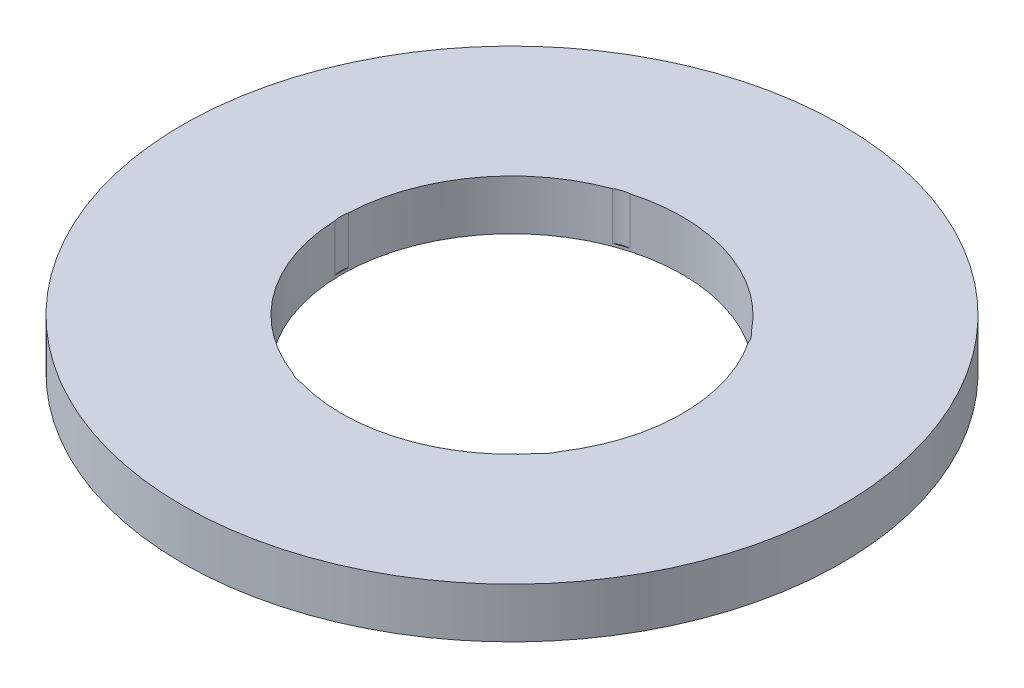
ISO-10303-21;
HEADER;
FILE_DESCRIPTION(('STEP AP214'),'2;1');
FILE_NAME('part.step','',(''),(''),'','','');
FILE_SCHEMA(('AUTOMOTIVE_DESIGN { 1 0 10303 214 1 1 1 1 }'));
ENDSEC;
DATA;
#1=APPLICATION_CONTEXT('core data for automotive mechanical design processes');
#2=APPLICATION_PROTOCOL_DEFINITION('international standard','automotive_design',2000,#1);
#3=PRODUCT_CONTEXT('',#1,'mechanical');
#4=PRODUCT('Part','Part','',(#3));
#5=PRODUCT_RELATED_PRODUCT_CATEGORY('part','',(#4));
#6=PRODUCT_DEFINITION_FORMATION('','',#4);
#7=PRODUCT_DEFINITION_CONTEXT('part definition',#1,'design');
#8=PRODUCT_DEFINITION('design','',#6,#7);
#9=PRODUCT_DEFINITION_SHAPE('','',#8);
#10=(LENGTH_UNIT() NAMED_UNIT(*) SI_UNIT(.MILLI.,.METRE.));
#11=(NAMED_UNIT(*) PLANE_ANGLE_UNIT() SI_UNIT($,.RADIAN.));
#12=(NAMED_UNIT(*) SI_UNIT($,.STERADIAN.) SOLID_ANGLE_UNIT());
#13=UNCERTAINTY_MEASURE_WITH_UNIT(LENGTH_MEASURE(1.E-05),#10,'distance_accuracy_value','');
#14=(GEOMETRIC_REPRESENTATION_CONTEXT(3) GLOBAL_UNCERTAINTY_ASSIGNED_CONTEXT((#13)) GLOBAL_UNIT_ASSIGNED_CONTEXT((#10,
#11,#12)) REPRESENTATION_CONTEXT('',''));
#15=CARTESIAN_POINT('',(0.,0.,0.));
#16=DIRECTION('',(0.,0.,1.));
#17=DIRECTION('',(1.,0.,0.));
#18=AXIS2_PLACEMENT_3D('',#15,#16,#17);
#19=CARTESIAN_POINT('',(0.,11.,0.));
#20=DIRECTION('',(0.,-1.,0.));
#21=DIRECTION('',(0.,0.,-1.));
#22=AXIS2_PLACEMENT_3D('',#19,#20,#21);
#23=CYLINDRICAL_SURFACE('',#22,72.5);
#24=CARTESIAN_POINT('',(0.,11.,0.));
#25=DIRECTION('',(0.,1.,0.));
#26=DIRECTION('',(0.,0.,1.));
#27=AXIS2_PLACEMENT_3D('',#24,#25,#26);
#28=CIRCLE('',#27,72.5);
#29=CARTESIAN_POINT('',(0.,11.,72.5));
#30=VERTEX_POINT('',#29);
#31=EDGE_CURVE('E151',#30,#30,#28,.T.);
#32=ORIENTED_EDGE('',*,*,#31,.F.);
#33=EDGE_LOOP('',(#32));
#34=FACE_BOUND('',#33,.T.);
#35=CARTESIAN_POINT('',(0.,0.,0.));
#36=DIRECTION('',(0.,1.,0.));
#37=DIRECTION('',(0.,0.,1.));
#38=AXIS2_PLACEMENT_3D('',#35,#36,#37);
#39=CIRCLE('',#38,72.5);
#40=CARTESIAN_POINT('',(0.,0.,72.5));
#41=VERTEX_POINT('',#40);
#42=EDGE_CURVE('E150',#41,#41,#39,.T.);
#43=ORIENTED_EDGE('',*,*,#42,.T.);
#44=EDGE_LOOP('',(#43));
#45=FACE_BOUND('',#44,.T.);
#46=ADVANCED_FACE('F39',(#34,#45),#23,.T.);
#47=CARTESIAN_POINT('',(0.,11.,0.));
#48=DIRECTION('',(0.,1.,0.));
#49=DIRECTION('',(0.,0.,1.));
#50=AXIS2_PLACEMENT_3D('',#47,#48,#49);
#51=PLANE('',#50);
#52=CARTESIAN_POINT('',(-9.75995920303515,11.,-30.0380657626822));
#53=DIRECTION('',(0.,1.,0.));
#54=DIRECTION('',(-0.95105651629515,0.,0.309016994374958));
#55=AXIS2_PLACEMENT_3D('',#52,#53,#54);
#56=CIRCLE('',#55,6.0783892815218);
#57=CARTESIAN_POINT('',(-10.1330941288525,11.,-36.1049913914381));
#58=VERTEX_POINT('',#57);
#59=CARTESIAN_POINT('',(-13.0241361181921,11.,-35.1656349064652));
#60=VERTEX_POINT('',#59);
#61=EDGE_CURVE('E196',#58,#60,#56,.T.);
#62=ORIENTED_EDGE('',*,*,#61,.F.);
#63=CARTESIAN_POINT('',(0.,11.,0.));
#64=DIRECTION('',(0.,1.,0.));
#65=DIRECTION('',(0.,0.,1.));
#66=AXIS2_PLACEMENT_3D('',#63,#64,#65);
#67=CIRCLE('',#66,37.5);
#68=CARTESIAN_POINT('',(29.4198268298762,11.,-23.2534683284042));
#69=VERTEX_POINT('',#68);
#70=EDGE_CURVE('E156',#69,#58,#67,.T.);
#71=ORIENTED_EDGE('',*,*,#70,.F.);
#72=CARTESIAN_POINT('',(25.5519049223573,11.,-18.5645455976424));
#73=DIRECTION('',(0.,1.,0.));
#74=DIRECTION('',(-0.58778525229248,0.,-0.809016994374942));
#75=AXIS2_PLACEMENT_3D('',#72,#73,#74);
#76=CIRCLE('',#75,6.0783892815218);
#77=CARTESIAN_POINT('',(31.2065890421912,11.,-20.7942011231928));
#78=VERTEX_POINT('',#77);
#79=EDGE_CURVE('E254',#78,#69,#76,.T.);
#80=ORIENTED_EDGE('',*,*,#79,.F.);
#81=CARTESIAN_POINT('',(31.2065890421915,11.,20.7942011231923));
#82=VERTEX_POINT('',#81);
#83=EDGE_CURVE('E153',#82,#78,#67,.T.);
#84=ORIENTED_EDGE('',*,*,#83,.F.);
#85=CARTESIAN_POINT('',(25.5519049223576,11.,18.5645455976421));
#86=DIRECTION('',(0.,1.,0.));
#87=DIRECTION('',(0.587785252292469,0.,-0.809016994374951));
#88=AXIS2_PLACEMENT_3D('',#85,#86,#87);
#89=CIRCLE('',#88,6.0783892815218);
#90=CARTESIAN_POINT('',(29.4198268298765,11.,23.2534683284038));
#91=VERTEX_POINT('',#90);
#92=EDGE_CURVE('E248',#91,#82,#89,.T.);
#93=ORIENTED_EDGE('',*,*,#92,.F.);
#94=CARTESIAN_POINT('',(-10.1330941288519,11.,36.1049913914382));
#95=VERTEX_POINT('',#94);
#96=EDGE_CURVE('E140',#95,#91,#67,.T.);
#97=ORIENTED_EDGE('',*,*,#96,.F.);
#98=CARTESIAN_POINT('',(-9.75995920303473,11.,30.0380657626824));
#99=DIRECTION('',(0.,1.,0.));
#100=DIRECTION('',(0.951056516295155,0.,0.309016994374945));
#101=AXIS2_PLACEMENT_3D('',#98,#99,#100);
#102=CIRCLE('',#101,6.0783892815218);
#103=CARTESIAN_POINT('',(-13.0241361181917,11.,35.1656349064654));
#104=VERTEX_POINT('',#103);
#105=EDGE_CURVE('E117',#104,#95,#102,.T.);
#106=ORIENTED_EDGE('',*,*,#105,.F.);
#107=CARTESIAN_POINT('',(-37.469185625024,11.,1.51991072023867));
#108=VERTEX_POINT('',#107);
#109=EDGE_CURVE('E133',#108,#104,#67,.T.);
#110=ORIENTED_EDGE('',*,*,#109,.F.);
#111=CARTESIAN_POINT('',(-31.5838914386453,11.,0.));
#112=DIRECTION('',(0.,1.,0.));
#113=DIRECTION('',(0.,0.,1.));
#114=AXIS2_PLACEMENT_3D('',#111,#112,#113);
#115=CIRCLE('',#114,6.0783892815218);
#116=CARTESIAN_POINT('',(-37.469185625024,11.,-1.51991072023867));
#117=VERTEX_POINT('',#116);
#118=EDGE_CURVE('E170',#117,#108,#115,.T.);
#119=ORIENTED_EDGE('',*,*,#118,.F.);
#120=EDGE_CURVE('E149',#60,#117,#67,.T.);
#121=ORIENTED_EDGE('',*,*,#120,.F.);
#122=EDGE_LOOP('',(#62,#71,#80,#84,#93,#97,#106,#110,#119,#121));
#123=FACE_BOUND('',#122,.T.);
#124=ORIENTED_EDGE('',*,*,#31,.T.);
#125=EDGE_LOOP('',(#124));
#126=FACE_BOUND('',#125,.T.);
#127=ADVANCED_FACE('F131',(#123,#126),#51,.T.);
#128=CARTESIAN_POINT('',(0.,0.,0.));
#129=DIRECTION('',(0.,1.,0.));
#130=DIRECTION('',(0.,0.,1.));
#131=AXIS2_PLACEMENT_3D('',#128,#129,#130);
#132=PLANE('',#131);
#133=CARTESIAN_POINT('',(0.,0.,0.));
#134=DIRECTION('',(0.,1.,0.));
#135=DIRECTION('',(0.,0.,1.));
#136=AXIS2_PLACEMENT_3D('',#133,#134,#135);
#137=CIRCLE('',#136,37.5);
#138=CARTESIAN_POINT('',(0.,0.,37.5));
#139=VERTEX_POINT('',#138);
#140=EDGE_CURVE('E160',#139,#139,#137,.T.);
#141=ORIENTED_EDGE('',*,*,#140,.T.);
#142=EDGE_LOOP('',(#141));
#143=FACE_BOUND('',#142,.T.);
#144=ORIENTED_EDGE('',*,*,#42,.F.);
#145=EDGE_LOOP('',(#144));
#146=FACE_BOUND('',#145,.T.);
#147=ADVANCED_FACE('F212',(#143,#146),#132,.F.);
#148=CARTESIAN_POINT('',(0.,11.,0.));
#149=DIRECTION('',(0.,-1.,0.));
#150=DIRECTION('',(0.,0.,-1.));
#151=AXIS2_PLACEMENT_3D('',#148,#149,#150);
#152=CYLINDRICAL_SURFACE('',#151,37.5);
#153=DIRECTION('',(0.,1.,0.));
#154=VECTOR('',#153,1.);
#155=CARTESIAN_POINT('',(-10.1330941288525,5.79717778050128,-36.1049913914381));
#156=LINE('',#155,#154);
#157=CARTESIAN_POINT('',(-10.1330941288525,0.59435556100257,-36.1049913914381));
#158=VERTEX_POINT('',#157);
#159=EDGE_CURVE('E11',#158,#58,#156,.T.);
#160=ORIENTED_EDGE('',*,*,#159,.F.);
#161=CARTESIAN_POINT('',(0.,0.59435556100257,0.));
#162=DIRECTION('',(0.,1.,0.));
#163=DIRECTION('',(0.,0.,1.));
#164=AXIS2_PLACEMENT_3D('',#161,#162,#163);
#165=CIRCLE('',#164,37.5);
#166=CARTESIAN_POINT('',(-13.0241361181921,0.59435556100257,-35.1656349064652));
#167=VERTEX_POINT('',#166);
#168=EDGE_CURVE('E193',#158,#167,#165,.T.);
#169=ORIENTED_EDGE('',*,*,#168,.T.);
#170=DIRECTION('',(0.,1.,0.));
#171=VECTOR('',#170,1.);
#172=CARTESIAN_POINT('',(-13.0241361181921,5.79717778050128,-35.1656349064652));
#173=LINE('',#172,#171);
#174=EDGE_CURVE('E46',#60,#167,#173,.F.);
#175=ORIENTED_EDGE('',*,*,#174,.F.);
#176=ORIENTED_EDGE('',*,*,#120,.T.);
#177=DIRECTION('',(0.,1.,0.));
#178=VECTOR('',#177,1.);
#179=CARTESIAN_POINT('',(-37.469185625024,5.79717778050128,-1.51991072023863));
#180=LINE('',#179,#178);
#181=CARTESIAN_POINT('',(-37.469185625024,0.59435556100257,-1.51991072023867));
#182=VERTEX_POINT('',#181);
#183=EDGE_CURVE('E174',#182,#117,#180,.T.);
#184=ORIENTED_EDGE('',*,*,#183,.F.);
#185=CARTESIAN_POINT('',(0.,0.59435556100257,0.));
#186=DIRECTION('',(0.,1.,0.));
#187=DIRECTION('',(0.,0.,1.));
#188=AXIS2_PLACEMENT_3D('',#185,#186,#187);
#189=CIRCLE('',#188,37.5);
#190=CARTESIAN_POINT('',(-37.469185625024,0.59435556100257,1.51991072023867));
#191=VERTEX_POINT('',#190);
#192=EDGE_CURVE('E171',#182,#191,#189,.T.);
#193=ORIENTED_EDGE('',*,*,#192,.T.);
#194=DIRECTION('',(0.,1.,0.));
#195=VECTOR('',#194,1.);
#196=CARTESIAN_POINT('',(-37.469185625024,5.79717778050128,1.51991072023863));
#197=LINE('',#196,#195);
#198=EDGE_CURVE('E148',#108,#191,#197,.F.);
#199=ORIENTED_EDGE('',*,*,#198,.F.);
#200=ORIENTED_EDGE('',*,*,#109,.T.);
#201=DIRECTION('',(0.,1.,0.));
#202=VECTOR('',#201,1.);
#203=CARTESIAN_POINT('',(-13.0241361181916,5.79717778050128,35.1656349064654));
#204=LINE('',#203,#202);
#205=CARTESIAN_POINT('',(-13.0241361181917,0.59435556100257,35.1656349064654));
#206=VERTEX_POINT('',#205);
#207=EDGE_CURVE('E111',#206,#104,#204,.T.);
#208=ORIENTED_EDGE('',*,*,#207,.F.);
#209=CARTESIAN_POINT('',(0.,0.59435556100257,0.));
#210=DIRECTION('',(0.,1.,0.));
#211=DIRECTION('',(0.,0.,1.));
#212=AXIS2_PLACEMENT_3D('',#209,#210,#211);
#213=CIRCLE('',#212,37.5);
#214=CARTESIAN_POINT('',(-10.1330941288519,0.59435556100257,36.1049913914382));
#215=VERTEX_POINT('',#214);
#216=EDGE_CURVE('E180',#206,#215,#213,.T.);
#217=ORIENTED_EDGE('',*,*,#216,.T.);
#218=DIRECTION('',(0.,1.,0.));
#219=VECTOR('',#218,1.);
#220=CARTESIAN_POINT('',(-10.133094128852,5.79717778050128,36.1049913914382));
#221=LINE('',#220,#219);
#222=EDGE_CURVE('E124',#95,#215,#221,.F.);
#223=ORIENTED_EDGE('',*,*,#222,.F.);
#224=ORIENTED_EDGE('',*,*,#96,.T.);
#225=DIRECTION('',(0.,1.,0.));
#226=VECTOR('',#225,1.);
#227=CARTESIAN_POINT('',(29.4198268298765,5.79717778050128,23.2534683284038));
#228=LINE('',#227,#226);
#229=CARTESIAN_POINT('',(29.4198268298765,0.59435556100257,23.2534683284038));
#230=VERTEX_POINT('',#229);
#231=EDGE_CURVE('E183',#230,#91,#228,.T.);
#232=ORIENTED_EDGE('',*,*,#231,.F.);
#233=CARTESIAN_POINT('',(0.,0.59435556100257,0.));
#234=DIRECTION('',(0.,1.,0.));
#235=DIRECTION('',(0.,0.,1.));
#236=AXIS2_PLACEMENT_3D('',#233,#234,#235);
#237=CIRCLE('',#236,37.5);
#238=CARTESIAN_POINT('',(31.2065890421915,0.59435556100257,20.7942011231923));
#239=VERTEX_POINT('',#238);
#240=EDGE_CURVE('E123',#230,#239,#237,.T.);
#241=ORIENTED_EDGE('',*,*,#240,.T.);
#242=DIRECTION('',(0.,1.,0.));
#243=VECTOR('',#242,1.);
#244=CARTESIAN_POINT('',(31.2065890421915,5.79717778050128,20.7942011231923));
#245=LINE('',#244,#243);
#246=EDGE_CURVE('E185',#82,#239,#245,.F.);
#247=ORIENTED_EDGE('',*,*,#246,.F.);
#248=ORIENTED_EDGE('',*,*,#83,.T.);
#249=DIRECTION('',(0.,1.,0.));
#250=VECTOR('',#249,1.);
#251=CARTESIAN_POINT('',(31.2065890421912,5.79717778050128,-20.7942011231928));
#252=LINE('',#251,#250);
#253=CARTESIAN_POINT('',(31.2065890421912,0.59435556100257,-20.7942011231928));
#254=VERTEX_POINT('',#253);
#255=EDGE_CURVE('E195',#254,#78,#252,.T.);
#256=ORIENTED_EDGE('',*,*,#255,.F.);
#257=CARTESIAN_POINT('',(0.,0.59435556100257,0.));
#258=DIRECTION('',(0.,1.,0.));
#259=DIRECTION('',(0.,0.,1.));
#260=AXIS2_PLACEMENT_3D('',#257,#258,#259);
#261=CIRCLE('',#260,37.5);
#262=CARTESIAN_POINT('',(29.4198268298762,0.59435556100257,-23.2534683284042));
#263=VERTEX_POINT('',#262);
#264=EDGE_CURVE('E190',#254,#263,#261,.T.);
#265=ORIENTED_EDGE('',*,*,#264,.T.);
#266=DIRECTION('',(0.,1.,0.));
#267=VECTOR('',#266,1.);
#268=CARTESIAN_POINT('',(29.4198268298762,5.79717778050128,-23.2534683284042));
#269=LINE('',#268,#267);
#270=EDGE_CURVE('E189',#69,#263,#269,.F.);
#271=ORIENTED_EDGE('',*,*,#270,.F.);
#272=ORIENTED_EDGE('',*,*,#70,.T.);
#273=EDGE_LOOP('',(#160,#169,#175,#176,#184,#193,#199,#200,#208,#217,#223,#224,#232,#241,#247,
#248,#256,#265,#271,#272));
#274=FACE_BOUND('',#273,.T.);
#275=ORIENTED_EDGE('',*,*,#140,.F.);
#276=EDGE_LOOP('',(#275));
#277=FACE_BOUND('',#276,.T.);
#278=ADVANCED_FACE('F142',(#274,#277),#152,.F.);
#279=CARTESIAN_POINT('',(-31.5838914386453,0.59435556100257,0.));
#280=DIRECTION('',(0.,1.,0.));
#281=DIRECTION('',(0.,0.,1.));
#282=AXIS2_PLACEMENT_3D('',#279,#280,#281);
#283=CYLINDRICAL_SURFACE('',#282,6.0783892815218);
#284=ORIENTED_EDGE('',*,*,#183,.T.);
#285=ORIENTED_EDGE('',*,*,#118,.T.);
#286=ORIENTED_EDGE('',*,*,#198,.T.);
#287=CARTESIAN_POINT('',(-31.5838914386453,0.59435556100257,0.));
#288=DIRECTION('',(0.,1.,0.));
#289=DIRECTION('',(0.,0.,1.));
#290=AXIS2_PLACEMENT_3D('',#287,#288,#289);
#291=CIRCLE('',#290,6.0783892815218);
#292=EDGE_CURVE('E163',#182,#191,#291,.T.);
#293=ORIENTED_EDGE('',*,*,#292,.F.);
#294=EDGE_LOOP('',(#284,#285,#286,#293));
#295=FACE_BOUND('',#294,.T.);
#296=ADVANCED_FACE('F221',(#295),#283,.F.);
#297=CARTESIAN_POINT('',(-31.5838914386453,0.59435556100257,0.));
#298=DIRECTION('',(0.,1.,0.));
#299=DIRECTION('',(0.,0.,1.));
#300=AXIS2_PLACEMENT_3D('',#297,#298,#299);
#301=PLANE('',#300);
#302=ORIENTED_EDGE('',*,*,#292,.T.);
#303=ORIENTED_EDGE('',*,*,#192,.F.);
#304=EDGE_LOOP('',(#302,#303));
#305=FACE_BOUND('',#304,.T.);
#306=ADVANCED_FACE('F227',(#305),#301,.T.);
#307=CARTESIAN_POINT('',(-9.75995920303473,0.59435556100257,30.0380657626824));
#308=DIRECTION('',(0.,1.,0.));
#309=DIRECTION('',(0.,0.,1.));
#310=AXIS2_PLACEMENT_3D('',#307,#308,#309);
#311=CYLINDRICAL_SURFACE('',#310,6.0783892815218);
#312=ORIENTED_EDGE('',*,*,#207,.T.);
#313=ORIENTED_EDGE('',*,*,#105,.T.);
#314=ORIENTED_EDGE('',*,*,#222,.T.);
#315=CARTESIAN_POINT('',(-9.75995920303473,0.59435556100257,30.0380657626824));
#316=DIRECTION('',(0.,1.,0.));
#317=DIRECTION('',(0.951056516295155,0.,0.309016994374945));
#318=AXIS2_PLACEMENT_3D('',#315,#316,#317);
#319=CIRCLE('',#318,6.0783892815218);
#320=EDGE_CURVE('E119',#206,#215,#319,.T.);
#321=ORIENTED_EDGE('',*,*,#320,.F.);
#322=EDGE_LOOP('',(#312,#313,#314,#321));
#323=FACE_BOUND('',#322,.T.);
#324=ADVANCED_FACE('F116',(#323),#311,.F.);
#325=CARTESIAN_POINT('',(-9.75995920303473,0.59435556100257,30.0380657626824));
#326=DIRECTION('',(0.,1.,0.));
#327=DIRECTION('',(0.951056516295155,0.,0.309016994374945));
#328=AXIS2_PLACEMENT_3D('',#325,#326,#327);
#329=PLANE('',#328);
#330=ORIENTED_EDGE('',*,*,#320,.T.);
#331=ORIENTED_EDGE('',*,*,#216,.F.);
#332=EDGE_LOOP('',(#330,#331));
#333=FACE_BOUND('',#332,.T.);
#334=ADVANCED_FACE('F234',(#333),#329,.T.);
#335=CARTESIAN_POINT('',(25.5519049223576,0.59435556100257,18.5645455976421));
#336=DIRECTION('',(0.,1.,0.));
#337=DIRECTION('',(0.,0.,1.));
#338=AXIS2_PLACEMENT_3D('',#335,#336,#337);
#339=CYLINDRICAL_SURFACE('',#338,6.0783892815218);
#340=ORIENTED_EDGE('',*,*,#231,.T.);
#341=ORIENTED_EDGE('',*,*,#92,.T.);
#342=ORIENTED_EDGE('',*,*,#246,.T.);
#343=CARTESIAN_POINT('',(25.5519049223576,0.59435556100257,18.5645455976421));
#344=DIRECTION('',(0.,1.,0.));
#345=DIRECTION('',(0.587785252292469,0.,-0.809016994374951));
#346=AXIS2_PLACEMENT_3D('',#343,#344,#345);
#347=CIRCLE('',#346,6.0783892815218);
#348=EDGE_CURVE('E137',#230,#239,#347,.T.);
#349=ORIENTED_EDGE('',*,*,#348,.F.);
#350=EDGE_LOOP('',(#340,#341,#342,#349));
#351=FACE_BOUND('',#350,.T.);
#352=ADVANCED_FACE('F240',(#351),#339,.F.);
#353=CARTESIAN_POINT('',(25.5519049223576,0.59435556100257,18.5645455976421));
#354=DIRECTION('',(0.,1.,0.));
#355=DIRECTION('',(0.587785252292469,0.,-0.809016994374951));
#356=AXIS2_PLACEMENT_3D('',#353,#354,#355);
#357=PLANE('',#356);
#358=ORIENTED_EDGE('',*,*,#348,.T.);
#359=ORIENTED_EDGE('',*,*,#240,.F.);
#360=EDGE_LOOP('',(#358,#359));
#361=FACE_BOUND('',#360,.T.);
#362=ADVANCED_FACE('F245',(#361),#357,.T.);
#363=CARTESIAN_POINT('',(25.5519049223573,0.59435556100257,-18.5645455976424));
#364=DIRECTION('',(0.,1.,0.));
#365=DIRECTION('',(0.,0.,1.));
#366=AXIS2_PLACEMENT_3D('',#363,#364,#365);
#367=CYLINDRICAL_SURFACE('',#366,6.0783892815218);
#368=ORIENTED_EDGE('',*,*,#255,.T.);
#369=ORIENTED_EDGE('',*,*,#79,.T.);
#370=ORIENTED_EDGE('',*,*,#270,.T.);
#371=CARTESIAN_POINT('',(25.5519049223573,0.59435556100257,-18.5645455976424));
#372=DIRECTION('',(0.,1.,0.));
#373=DIRECTION('',(-0.58778525229248,0.,-0.809016994374942));
#374=AXIS2_PLACEMENT_3D('',#371,#372,#373);
#375=CIRCLE('',#374,6.0783892815218);
#376=EDGE_CURVE('E56',#254,#263,#375,.T.);
#377=ORIENTED_EDGE('',*,*,#376,.F.);
#378=EDGE_LOOP('',(#368,#369,#370,#377));
#379=FACE_BOUND('',#378,.T.);
#380=ADVANCED_FACE('F264',(#379),#367,.F.);
#381=CARTESIAN_POINT('',(25.5519049223573,0.59435556100257,-18.5645455976424));
#382=DIRECTION('',(0.,1.,0.));
#383=DIRECTION('',(-0.58778525229248,0.,-0.809016994374942));
#384=AXIS2_PLACEMENT_3D('',#381,#382,#383);
#385=PLANE('',#384);
#386=ORIENTED_EDGE('',*,*,#376,.T.);
#387=ORIENTED_EDGE('',*,*,#264,.F.);
#388=EDGE_LOOP('',(#386,#387));
#389=FACE_BOUND('',#388,.T.);
#390=ADVANCED_FACE('F202',(#389),#385,.T.);
#391=CARTESIAN_POINT('',(-9.75995920303515,0.59435556100257,-30.0380657626822));
#392=DIRECTION('',(0.,1.,0.));
#393=DIRECTION('',(0.,0.,1.));
#394=AXIS2_PLACEMENT_3D('',#391,#392,#393);
#395=CYLINDRICAL_SURFACE('',#394,6.0783892815218);
#396=ORIENTED_EDGE('',*,*,#159,.T.);
#397=ORIENTED_EDGE('',*,*,#61,.T.);
#398=ORIENTED_EDGE('',*,*,#174,.T.);
#399=CARTESIAN_POINT('',(-9.75995920303515,0.59435556100257,-30.0380657626822));
#400=DIRECTION('',(0.,1.,0.));
#401=DIRECTION('',(-0.95105651629515,0.,0.309016994374958));
#402=AXIS2_PLACEMENT_3D('',#399,#400,#401);
#403=CIRCLE('',#402,6.0783892815218);
#404=EDGE_CURVE('E55',#158,#167,#403,.T.);
#405=ORIENTED_EDGE('',*,*,#404,.F.);
#406=EDGE_LOOP('',(#396,#397,#398,#405));
#407=FACE_BOUND('',#406,.T.);
#408=ADVANCED_FACE('F197',(#407),#395,.F.);
#409=CARTESIAN_POINT('',(-9.75995920303515,0.59435556100257,-30.0380657626822));
#410=DIRECTION('',(0.,1.,0.));
#411=DIRECTION('',(-0.95105651629515,0.,0.309016994374958));
#412=AXIS2_PLACEMENT_3D('',#409,#410,#411);
#413=PLANE('',#412);
#414=ORIENTED_EDGE('',*,*,#404,.T.);
#415=ORIENTED_EDGE('',*,*,#168,.F.);
#416=EDGE_LOOP('',(#414,#415));
#417=FACE_BOUND('',#416,.T.);
#418=ADVANCED_FACE('F200',(#417),#413,.T.);
#419=CLOSED_SHELL('',(#46,#127,#147,#278,#296,#306,#324,#334,#352,#362,#380,#390,#408,#418));
#420=MANIFOLD_SOLID_BREP('B2',#419);
#421=ADVANCED_BREP_SHAPE_REPRESENTATION('',(#18,#420),#14);
#422=SHAPE_DEFINITION_REPRESENTATION(#9,#421);
ENDSEC;
END-ISO-10303-21;
